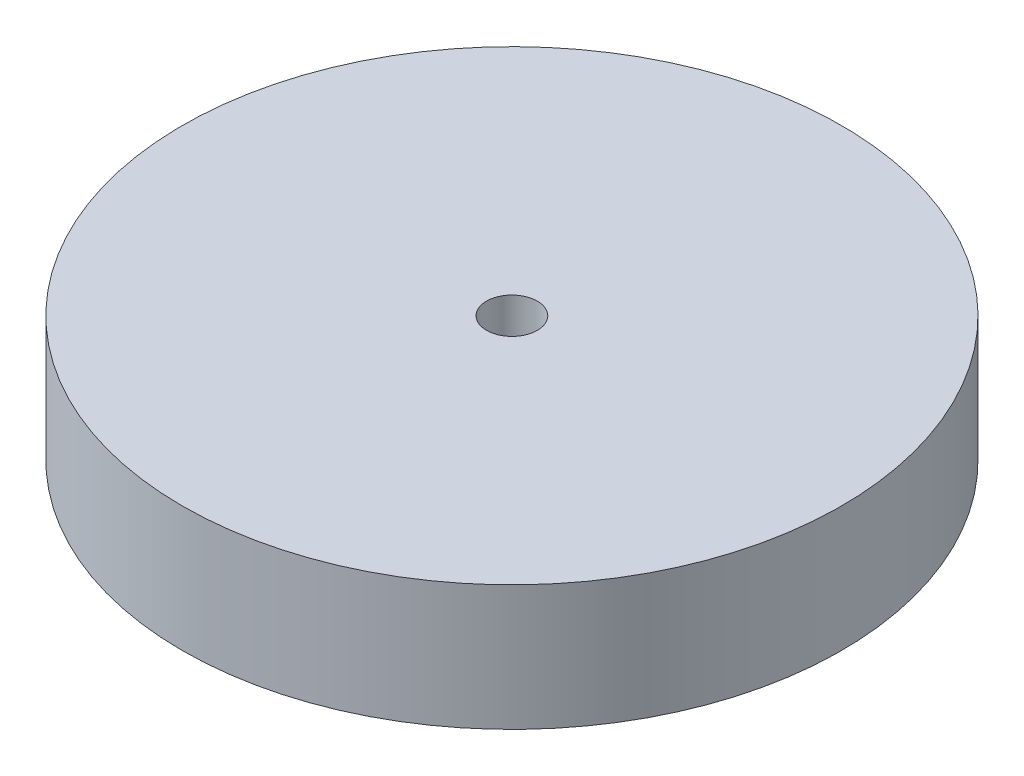
ISO-10303-21;
HEADER;
FILE_DESCRIPTION(('STEP AP214'),'2;1');
FILE_NAME('part.step','',(''),(''),'','','');
FILE_SCHEMA(('AUTOMOTIVE_DESIGN { 1 0 10303 214 1 1 1 1 }'));
ENDSEC;
DATA;
#1=APPLICATION_CONTEXT('core data for automotive mechanical design processes');
#2=APPLICATION_PROTOCOL_DEFINITION('international standard','automotive_design',2000,#1);
#3=PRODUCT_CONTEXT('',#1,'mechanical');
#4=PRODUCT('Part','Part','',(#3));
#5=PRODUCT_RELATED_PRODUCT_CATEGORY('part','',(#4));
#6=PRODUCT_DEFINITION_FORMATION('','',#4);
#7=PRODUCT_DEFINITION_CONTEXT('part definition',#1,'design');
#8=PRODUCT_DEFINITION('design','',#6,#7);
#9=PRODUCT_DEFINITION_SHAPE('','',#8);
#10=(LENGTH_UNIT() NAMED_UNIT(*) SI_UNIT(.MILLI.,.METRE.));
#11=(NAMED_UNIT(*) PLANE_ANGLE_UNIT() SI_UNIT($,.RADIAN.));
#12=(NAMED_UNIT(*) SI_UNIT($,.STERADIAN.) SOLID_ANGLE_UNIT());
#13=UNCERTAINTY_MEASURE_WITH_UNIT(LENGTH_MEASURE(1.E-05),#10,'distance_accuracy_value','');
#14=(GEOMETRIC_REPRESENTATION_CONTEXT(3) GLOBAL_UNCERTAINTY_ASSIGNED_CONTEXT((#13)) GLOBAL_UNIT_ASSIGNED_CONTEXT((#10,
#11,#12)) REPRESENTATION_CONTEXT('',''));
#15=CARTESIAN_POINT('',(0.,0.,0.));
#16=DIRECTION('',(0.,0.,1.));
#17=DIRECTION('',(1.,0.,0.));
#18=AXIS2_PLACEMENT_3D('',#15,#16,#17);
#19=CARTESIAN_POINT('',(0.,19.,0.));
#20=DIRECTION('',(0.,-1.,0.));
#21=DIRECTION('',(0.,0.,-1.));
#22=AXIS2_PLACEMENT_3D('',#19,#20,#21);
#23=CYLINDRICAL_SURFACE('',#22,50.);
#24=CARTESIAN_POINT('',(0.,19.,0.));
#25=DIRECTION('',(0.,1.,0.));
#26=DIRECTION('',(0.,0.,1.));
#27=AXIS2_PLACEMENT_3D('',#24,#25,#26);
#28=CIRCLE('',#27,50.);
#29=CARTESIAN_POINT('',(0.,19.,50.));
#30=VERTEX_POINT('',#29);
#31=EDGE_CURVE('E10',#30,#30,#28,.T.);
#32=ORIENTED_EDGE('',*,*,#31,.F.);
#33=EDGE_LOOP('',(#32));
#34=FACE_BOUND('',#33,.T.);
#35=CARTESIAN_POINT('',(0.,0.,0.));
#36=DIRECTION('',(0.,1.,0.));
#37=DIRECTION('',(0.,0.,1.));
#38=AXIS2_PLACEMENT_3D('',#35,#36,#37);
#39=CIRCLE('',#38,50.);
#40=CARTESIAN_POINT('',(0.,0.,50.));
#41=VERTEX_POINT('',#40);
#42=EDGE_CURVE('E36',#41,#41,#39,.T.);
#43=ORIENTED_EDGE('',*,*,#42,.T.);
#44=EDGE_LOOP('',(#43));
#45=FACE_BOUND('',#44,.T.);
#46=ADVANCED_FACE('F33',(#34,#45),#23,.T.);
#47=CARTESIAN_POINT('',(0.,19.,0.));
#48=DIRECTION('',(0.,1.,0.));
#49=DIRECTION('',(0.,0.,1.));
#50=AXIS2_PLACEMENT_3D('',#47,#48,#49);
#51=PLANE('',#50);
#52=CARTESIAN_POINT('',(0.,19.,0.));
#53=DIRECTION('',(0.,1.,0.));
#54=DIRECTION('',(0.,0.,1.));
#55=AXIS2_PLACEMENT_3D('',#52,#53,#54);
#56=CIRCLE('',#55,3.85);
#57=CARTESIAN_POINT('',(0.,19.,3.85));
#58=VERTEX_POINT('',#57);
#59=EDGE_CURVE('E45',#58,#58,#56,.T.);
#60=ORIENTED_EDGE('',*,*,#59,.F.);
#61=EDGE_LOOP('',(#60));
#62=FACE_BOUND('',#61,.T.);
#63=ORIENTED_EDGE('',*,*,#31,.T.);
#64=EDGE_LOOP('',(#63));
#65=FACE_BOUND('',#64,.T.);
#66=ADVANCED_FACE('F60',(#62,#65),#51,.T.);
#67=CARTESIAN_POINT('',(0.,0.,0.));
#68=DIRECTION('',(0.,1.,0.));
#69=DIRECTION('',(0.,0.,1.));
#70=AXIS2_PLACEMENT_3D('',#67,#68,#69);
#71=PLANE('',#70);
#72=CARTESIAN_POINT('',(0.,0.,0.));
#73=DIRECTION('',(0.,1.,0.));
#74=DIRECTION('',(0.,0.,1.));
#75=AXIS2_PLACEMENT_3D('',#72,#73,#74);
#76=CIRCLE('',#75,3.85);
#77=CARTESIAN_POINT('',(0.,0.,3.85));
#78=VERTEX_POINT('',#77);
#79=EDGE_CURVE('E43',#78,#78,#76,.T.);
#80=ORIENTED_EDGE('',*,*,#79,.T.);
#81=EDGE_LOOP('',(#80));
#82=FACE_BOUND('',#81,.T.);
#83=ORIENTED_EDGE('',*,*,#42,.F.);
#84=EDGE_LOOP('',(#83));
#85=FACE_BOUND('',#84,.T.);
#86=ADVANCED_FACE('F51',(#82,#85),#71,.F.);
#87=CARTESIAN_POINT('',(0.,0.,0.));
#88=DIRECTION('',(0.,1.,0.));
#89=DIRECTION('',(0.,0.,1.));
#90=AXIS2_PLACEMENT_3D('',#87,#88,#89);
#91=CYLINDRICAL_SURFACE('',#90,3.85);
#92=ORIENTED_EDGE('',*,*,#79,.F.);
#93=EDGE_LOOP('',(#92));
#94=FACE_BOUND('',#93,.T.);
#95=ORIENTED_EDGE('',*,*,#59,.T.);
#96=EDGE_LOOP('',(#95));
#97=FACE_BOUND('',#96,.T.);
#98=ADVANCED_FACE('F54',(#94,#97),#91,.F.);
#99=CLOSED_SHELL('',(#46,#66,#86,#98));
#100=MANIFOLD_SOLID_BREP('B2',#99);
#101=ADVANCED_BREP_SHAPE_REPRESENTATION('',(#18,#100),#14);
#102=SHAPE_DEFINITION_REPRESENTATION(#9,#101);
ENDSEC;
END-ISO-10303-21;
